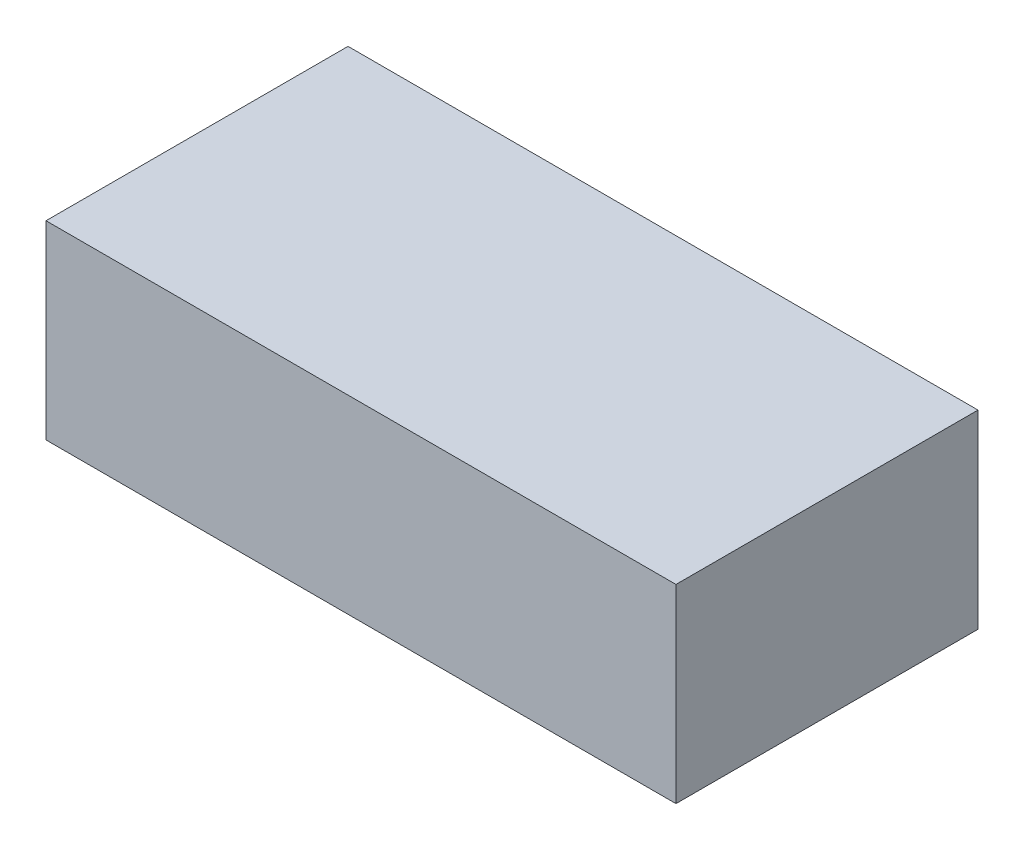
ISO-10303-21;
HEADER;
FILE_DESCRIPTION(('STEP AP214'),'2;1');
FILE_NAME('part.step','',(''),(''),'','','');
FILE_SCHEMA(('AUTOMOTIVE_DESIGN { 1 0 10303 214 1 1 1 1 }'));
ENDSEC;
DATA;
#1=APPLICATION_CONTEXT('core data for automotive mechanical design processes');
#2=APPLICATION_PROTOCOL_DEFINITION('international standard','automotive_design',2000,#1);
#3=PRODUCT_CONTEXT('',#1,'mechanical');
#4=PRODUCT('Part','Part','',(#3));
#5=PRODUCT_RELATED_PRODUCT_CATEGORY('part','',(#4));
#6=PRODUCT_DEFINITION_FORMATION('','',#4);
#7=PRODUCT_DEFINITION_CONTEXT('part definition',#1,'design');
#8=PRODUCT_DEFINITION('design','',#6,#7);
#9=PRODUCT_DEFINITION_SHAPE('','',#8);
#10=(LENGTH_UNIT() NAMED_UNIT(*) SI_UNIT(.MILLI.,.METRE.));
#11=(NAMED_UNIT(*) PLANE_ANGLE_UNIT() SI_UNIT($,.RADIAN.));
#12=(NAMED_UNIT(*) SI_UNIT($,.STERADIAN.) SOLID_ANGLE_UNIT());
#13=UNCERTAINTY_MEASURE_WITH_UNIT(LENGTH_MEASURE(1.E-05),#10,'distance_accuracy_value','');
#14=(GEOMETRIC_REPRESENTATION_CONTEXT(3) GLOBAL_UNCERTAINTY_ASSIGNED_CONTEXT((#13)) GLOBAL_UNIT_ASSIGNED_CONTEXT((#10,
#11,#12)) REPRESENTATION_CONTEXT('',''));
#15=CARTESIAN_POINT('',(0.,0.,0.));
#16=DIRECTION('',(0.,0.,1.));
#17=DIRECTION('',(1.,0.,0.));
#18=AXIS2_PLACEMENT_3D('',#15,#16,#17);
#19=CARTESIAN_POINT('',(-36.5,22.,-17.5));
#20=DIRECTION('',(1.,0.,0.));
#21=DIRECTION('',(0.,0.,-1.));
#22=AXIS2_PLACEMENT_3D('',#19,#20,#21);
#23=PLANE('',#22);
#24=DIRECTION('',(0.,0.,1.));
#25=VECTOR('',#24,1.);
#26=CARTESIAN_POINT('',(-36.5,0.,-17.5));
#27=LINE('',#26,#25);
#28=CARTESIAN_POINT('',(-36.5,0.,-17.5));
#29=VERTEX_POINT('',#28);
#30=CARTESIAN_POINT('',(-36.5,0.,17.5));
#31=VERTEX_POINT('',#30);
#32=EDGE_CURVE('E113',#29,#31,#27,.T.);
#33=ORIENTED_EDGE('',*,*,#32,.T.);
#34=DIRECTION('',(0.,-1.,0.));
#35=VECTOR('',#34,1.);
#36=CARTESIAN_POINT('',(-36.5,22.,17.5));
#37=LINE('',#36,#35);
#38=CARTESIAN_POINT('',(-36.5,22.,17.5));
#39=VERTEX_POINT('',#38);
#40=EDGE_CURVE('E11',#39,#31,#37,.T.);
#41=ORIENTED_EDGE('',*,*,#40,.F.);
#42=DIRECTION('',(0.,0.,1.));
#43=VECTOR('',#42,1.);
#44=CARTESIAN_POINT('',(-36.5,22.,-17.5));
#45=LINE('',#44,#43);
#46=CARTESIAN_POINT('',(-36.5,22.,-17.5));
#47=VERTEX_POINT('',#46);
#48=EDGE_CURVE('E97',#47,#39,#45,.T.);
#49=ORIENTED_EDGE('',*,*,#48,.F.);
#50=DIRECTION('',(0.,-1.,0.));
#51=VECTOR('',#50,1.);
#52=CARTESIAN_POINT('',(-36.5,22.,-17.5));
#53=LINE('',#52,#51);
#54=EDGE_CURVE('E109',#47,#29,#53,.T.);
#55=ORIENTED_EDGE('',*,*,#54,.T.);
#56=EDGE_LOOP('',(#33,#41,#49,#55));
#57=FACE_BOUND('',#56,.T.);
#58=ADVANCED_FACE('F45',(#57),#23,.F.);
#59=CARTESIAN_POINT('',(-36.5,22.,17.5));
#60=DIRECTION('',(0.,0.,-1.));
#61=DIRECTION('',(-1.,0.,0.));
#62=AXIS2_PLACEMENT_3D('',#59,#60,#61);
#63=PLANE('',#62);
#64=DIRECTION('',(1.,0.,0.));
#65=VECTOR('',#64,1.);
#66=CARTESIAN_POINT('',(-36.5,0.,17.5));
#67=LINE('',#66,#65);
#68=CARTESIAN_POINT('',(36.5,0.,17.5));
#69=VERTEX_POINT('',#68);
#70=EDGE_CURVE('E102',#31,#69,#67,.T.);
#71=ORIENTED_EDGE('',*,*,#70,.T.);
#72=DIRECTION('',(0.,-1.,0.));
#73=VECTOR('',#72,1.);
#74=CARTESIAN_POINT('',(36.5,22.,17.5));
#75=LINE('',#74,#73);
#76=CARTESIAN_POINT('',(36.5,22.,17.5));
#77=VERTEX_POINT('',#76);
#78=EDGE_CURVE('E54',#77,#69,#75,.T.);
#79=ORIENTED_EDGE('',*,*,#78,.F.);
#80=DIRECTION('',(1.,0.,0.));
#81=VECTOR('',#80,1.);
#82=CARTESIAN_POINT('',(-36.5,22.,17.5));
#83=LINE('',#82,#81);
#84=EDGE_CURVE('E92',#39,#77,#83,.T.);
#85=ORIENTED_EDGE('',*,*,#84,.F.);
#86=ORIENTED_EDGE('',*,*,#40,.T.);
#87=EDGE_LOOP('',(#71,#79,#85,#86));
#88=FACE_BOUND('',#87,.T.);
#89=ADVANCED_FACE('F101',(#88),#63,.F.);
#90=CARTESIAN_POINT('',(36.5,22.,-17.5));
#91=DIRECTION('',(-1.,0.,0.));
#92=DIRECTION('',(0.,0.,1.));
#93=AXIS2_PLACEMENT_3D('',#90,#91,#92);
#94=PLANE('',#93);
#95=DIRECTION('',(0.,0.,-1.));
#96=VECTOR('',#95,1.);
#97=CARTESIAN_POINT('',(36.5,0.,-17.5));
#98=LINE('',#97,#96);
#99=CARTESIAN_POINT('',(36.5,0.,-17.5));
#100=VERTEX_POINT('',#99);
#101=EDGE_CURVE('E79',#69,#100,#98,.T.);
#102=ORIENTED_EDGE('',*,*,#101,.T.);
#103=DIRECTION('',(0.,-1.,0.));
#104=VECTOR('',#103,1.);
#105=CARTESIAN_POINT('',(36.5,22.,-17.5));
#106=LINE('',#105,#104);
#107=CARTESIAN_POINT('',(36.5,22.,-17.5));
#108=VERTEX_POINT('',#107);
#109=EDGE_CURVE('E104',#108,#100,#106,.T.);
#110=ORIENTED_EDGE('',*,*,#109,.F.);
#111=DIRECTION('',(0.,0.,-1.));
#112=VECTOR('',#111,1.);
#113=CARTESIAN_POINT('',(36.5,22.,-17.5));
#114=LINE('',#113,#112);
#115=EDGE_CURVE('E95',#77,#108,#114,.T.);
#116=ORIENTED_EDGE('',*,*,#115,.F.);
#117=ORIENTED_EDGE('',*,*,#78,.T.);
#118=EDGE_LOOP('',(#102,#110,#116,#117));
#119=FACE_BOUND('',#118,.T.);
#120=ADVANCED_FACE('F105',(#119),#94,.F.);
#121=CARTESIAN_POINT('',(-36.5,22.,-17.5));
#122=DIRECTION('',(0.,0.,1.));
#123=DIRECTION('',(1.,0.,0.));
#124=AXIS2_PLACEMENT_3D('',#121,#122,#123);
#125=PLANE('',#124);
#126=DIRECTION('',(-1.,0.,0.));
#127=VECTOR('',#126,1.);
#128=CARTESIAN_POINT('',(-36.5,0.,-17.5));
#129=LINE('',#128,#127);
#130=EDGE_CURVE('E85',#100,#29,#129,.T.);
#131=ORIENTED_EDGE('',*,*,#130,.T.);
#132=ORIENTED_EDGE('',*,*,#54,.F.);
#133=DIRECTION('',(-1.,0.,0.));
#134=VECTOR('',#133,1.);
#135=CARTESIAN_POINT('',(-36.5,22.,-17.5));
#136=LINE('',#135,#134);
#137=EDGE_CURVE('E62',#108,#47,#136,.T.);
#138=ORIENTED_EDGE('',*,*,#137,.F.);
#139=ORIENTED_EDGE('',*,*,#109,.T.);
#140=EDGE_LOOP('',(#131,#132,#138,#139));
#141=FACE_BOUND('',#140,.T.);
#142=ADVANCED_FACE('F126',(#141),#125,.F.);
#143=CARTESIAN_POINT('',(0.,22.,0.));
#144=DIRECTION('',(0.,1.,0.));
#145=DIRECTION('',(0.,0.,1.));
#146=AXIS2_PLACEMENT_3D('',#143,#144,#145);
#147=PLANE('',#146);
#148=ORIENTED_EDGE('',*,*,#48,.T.);
#149=ORIENTED_EDGE('',*,*,#84,.T.);
#150=ORIENTED_EDGE('',*,*,#115,.T.);
#151=ORIENTED_EDGE('',*,*,#137,.T.);
#152=EDGE_LOOP('',(#148,#149,#150,#151));
#153=FACE_BOUND('',#152,.T.);
#154=ADVANCED_FACE('F93',(#153),#147,.T.);
#155=CARTESIAN_POINT('',(0.,0.,0.));
#156=DIRECTION('',(0.,1.,0.));
#157=DIRECTION('',(0.,0.,1.));
#158=AXIS2_PLACEMENT_3D('',#155,#156,#157);
#159=PLANE('',#158);
#160=ORIENTED_EDGE('',*,*,#32,.F.);
#161=ORIENTED_EDGE('',*,*,#130,.F.);
#162=ORIENTED_EDGE('',*,*,#101,.F.);
#163=ORIENTED_EDGE('',*,*,#70,.F.);
#164=EDGE_LOOP('',(#160,#161,#162,#163));
#165=FACE_BOUND('',#164,.T.);
#166=ADVANCED_FACE('F129',(#165),#159,.F.);
#167=CLOSED_SHELL('',(#58,#89,#120,#142,#154,#166));
#168=MANIFOLD_SOLID_BREP('B2',#167);
#169=ADVANCED_BREP_SHAPE_REPRESENTATION('',(#18,#168),#14);
#170=SHAPE_DEFINITION_REPRESENTATION(#9,#169);
ENDSEC;
END-ISO-10303-21;
